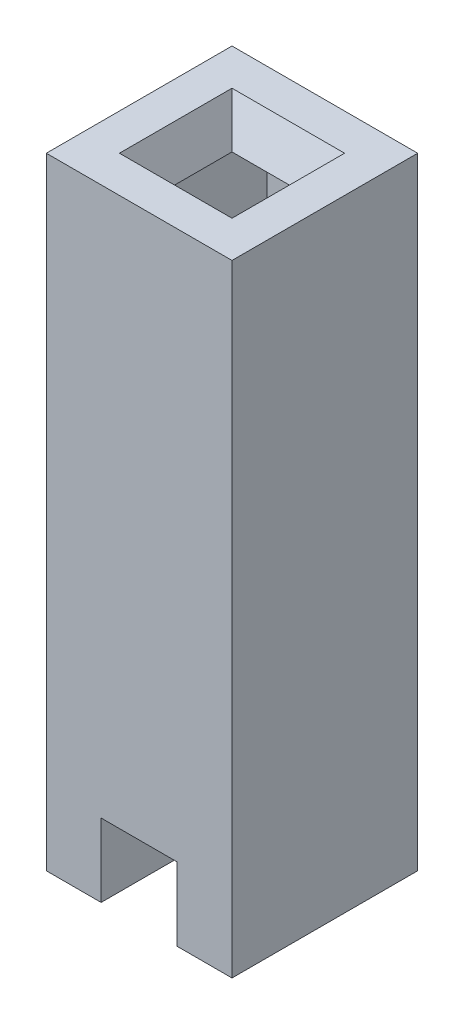
ISO-10303-21;
HEADER;
FILE_DESCRIPTION(('STEP AP214'),'2;1');
FILE_NAME('part.step','',(''),(''),'','','');
FILE_SCHEMA(('AUTOMOTIVE_DESIGN { 1 0 10303 214 1 1 1 1 }'));
ENDSEC;
DATA;
#1=APPLICATION_CONTEXT('core data for automotive mechanical design processes');
#2=APPLICATION_PROTOCOL_DEFINITION('international standard','automotive_design',2000,#1);
#3=PRODUCT_CONTEXT('',#1,'mechanical');
#4=PRODUCT('Part','Part','',(#3));
#5=PRODUCT_RELATED_PRODUCT_CATEGORY('part','',(#4));
#6=PRODUCT_DEFINITION_FORMATION('','',#4);
#7=PRODUCT_DEFINITION_CONTEXT('part definition',#1,'design');
#8=PRODUCT_DEFINITION('design','',#6,#7);
#9=PRODUCT_DEFINITION_SHAPE('','',#8);
#10=(LENGTH_UNIT() NAMED_UNIT(*) SI_UNIT(.MILLI.,.METRE.));
#11=(NAMED_UNIT(*) PLANE_ANGLE_UNIT() SI_UNIT($,.RADIAN.));
#12=(NAMED_UNIT(*) SI_UNIT($,.STERADIAN.) SOLID_ANGLE_UNIT());
#13=UNCERTAINTY_MEASURE_WITH_UNIT(LENGTH_MEASURE(1.E-05),#10,'distance_accuracy_value','');
#14=(GEOMETRIC_REPRESENTATION_CONTEXT(3) GLOBAL_UNCERTAINTY_ASSIGNED_CONTEXT((#13)) GLOBAL_UNIT_ASSIGNED_CONTEXT((#10,
#11,#12)) REPRESENTATION_CONTEXT('',''));
#15=CARTESIAN_POINT('',(0.,0.,0.));
#16=DIRECTION('',(0.,0.,1.));
#17=DIRECTION('',(1.,0.,0.));
#18=AXIS2_PLACEMENT_3D('',#15,#16,#17);
#19=CARTESIAN_POINT('',(-0.75,1.,2.54));
#20=DIRECTION('',(0.,1.,0.));
#21=DIRECTION('',(-1.,0.,0.));
#22=AXIS2_PLACEMENT_3D('',#19,#20,#21);
#23=PLANE('',#22);
#24=DIRECTION('',(0.,0.,-1.));
#25=VECTOR('',#24,1.);
#26=CARTESIAN_POINT('',(-1.79,1.,2.54));
#27=LINE('',#26,#25);
#28=CARTESIAN_POINT('',(-1.79,1.,2.54));
#29=VERTEX_POINT('',#28);
#30=CARTESIAN_POINT('',(-1.79,1.,2.27));
#31=VERTEX_POINT('',#30);
#32=EDGE_CURVE('E256',#29,#31,#27,.T.);
#33=ORIENTED_EDGE('',*,*,#32,.T.);
#34=DIRECTION('',(-1.,0.,0.));
#35=VECTOR('',#34,1.);
#36=CARTESIAN_POINT('',(-1.79,1.,2.27));
#37=LINE('',#36,#35);
#38=CARTESIAN_POINT('',(-0.75,1.,2.27));
#39=VERTEX_POINT('',#38);
#40=EDGE_CURVE('E197',#39,#31,#37,.T.);
#41=ORIENTED_EDGE('',*,*,#40,.F.);
#42=DIRECTION('',(0.,0.,-1.));
#43=VECTOR('',#42,1.);
#44=CARTESIAN_POINT('',(-0.75,1.,2.54));
#45=LINE('',#44,#43);
#46=CARTESIAN_POINT('',(-0.75,1.,2.54));
#47=VERTEX_POINT('',#46);
#48=EDGE_CURVE('E252',#47,#39,#45,.T.);
#49=ORIENTED_EDGE('',*,*,#48,.F.);
#50=DIRECTION('',(1.,0.,0.));
#51=VECTOR('',#50,1.);
#52=CARTESIAN_POINT('',(-0.75,1.,2.54));
#53=LINE('',#52,#51);
#54=EDGE_CURVE('E222',#29,#47,#53,.T.);
#55=ORIENTED_EDGE('',*,*,#54,.F.);
#56=EDGE_LOOP('',(#33,#41,#49,#55));
#57=FACE_BOUND('',#56,.T.);
#58=ADVANCED_FACE('F36',(#57),#23,.F.);
#59=CARTESIAN_POINT('',(0.,0.,2.54));
#60=DIRECTION('',(-1.,0.,0.));
#61=DIRECTION('',(0.,-1.,0.));
#62=AXIS2_PLACEMENT_3D('',#59,#60,#61);
#63=PLANE('',#62);
#64=DIRECTION('',(0.,1.,0.));
#65=VECTOR('',#64,1.);
#66=CARTESIAN_POINT('',(0.,0.,0.));
#67=LINE('',#66,#65);
#68=CARTESIAN_POINT('',(0.,0.,0.));
#69=VERTEX_POINT('',#68);
#70=CARTESIAN_POINT('',(0.,8.5,0.));
#71=VERTEX_POINT('',#70);
#72=EDGE_CURVE('E209',#69,#71,#67,.T.);
#73=ORIENTED_EDGE('',*,*,#72,.T.);
#74=DIRECTION('',(0.,0.,-1.));
#75=VECTOR('',#74,1.);
#76=CARTESIAN_POINT('',(0.,8.5,2.54));
#77=LINE('',#76,#75);
#78=CARTESIAN_POINT('',(0.,8.5,2.54));
#79=VERTEX_POINT('',#78);
#80=EDGE_CURVE('E12',#79,#71,#77,.T.);
#81=ORIENTED_EDGE('',*,*,#80,.F.);
#82=DIRECTION('',(0.,1.,0.));
#83=VECTOR('',#82,1.);
#84=CARTESIAN_POINT('',(0.,0.,2.54));
#85=LINE('',#84,#83);
#86=CARTESIAN_POINT('',(0.,0.,2.54));
#87=VERTEX_POINT('',#86);
#88=EDGE_CURVE('E210',#87,#79,#85,.T.);
#89=ORIENTED_EDGE('',*,*,#88,.F.);
#90=DIRECTION('',(0.,0.,-1.));
#91=VECTOR('',#90,1.);
#92=CARTESIAN_POINT('',(0.,0.,2.54));
#93=LINE('',#92,#91);
#94=EDGE_CURVE('E228',#87,#69,#93,.T.);
#95=ORIENTED_EDGE('',*,*,#94,.T.);
#96=EDGE_LOOP('',(#73,#81,#89,#95));
#97=FACE_BOUND('',#96,.T.);
#98=ADVANCED_FACE('F38',(#97),#63,.F.);
#99=CARTESIAN_POINT('',(0.,8.5,2.54));
#100=DIRECTION('',(0.,-1.,0.));
#101=DIRECTION('',(0.,0.,-1.));
#102=AXIS2_PLACEMENT_3D('',#99,#100,#101);
#103=PLANE('',#102);
#104=DIRECTION('',(-1.,0.,0.));
#105=VECTOR('',#104,1.);
#106=CARTESIAN_POINT('',(-0.5,8.5,0.5));
#107=LINE('',#106,#105);
#108=CARTESIAN_POINT('',(-0.5,8.5,0.5));
#109=VERTEX_POINT('',#108);
#110=CARTESIAN_POINT('',(-2.04,8.5,0.5));
#111=VERTEX_POINT('',#110);
#112=EDGE_CURVE('E172',#109,#111,#107,.T.);
#113=ORIENTED_EDGE('',*,*,#112,.F.);
#114=DIRECTION('',(0.,0.,-1.));
#115=VECTOR('',#114,1.);
#116=CARTESIAN_POINT('',(-0.5,8.5,2.04));
#117=LINE('',#116,#115);
#118=CARTESIAN_POINT('',(-0.5,8.5,2.04));
#119=VERTEX_POINT('',#118);
#120=EDGE_CURVE('E51',#119,#109,#117,.T.);
#121=ORIENTED_EDGE('',*,*,#120,.F.);
#122=DIRECTION('',(1.,0.,0.));
#123=VECTOR('',#122,1.);
#124=CARTESIAN_POINT('',(-2.04,8.5,2.04));
#125=LINE('',#124,#123);
#126=CARTESIAN_POINT('',(-2.04,8.5,2.04));
#127=VERTEX_POINT('',#126);
#128=EDGE_CURVE('E159',#127,#119,#125,.T.);
#129=ORIENTED_EDGE('',*,*,#128,.F.);
#130=DIRECTION('',(0.,0.,1.));
#131=VECTOR('',#130,1.);
#132=CARTESIAN_POINT('',(-2.04,8.5,0.5));
#133=LINE('',#132,#131);
#134=EDGE_CURVE('E167',#111,#127,#133,.T.);
#135=ORIENTED_EDGE('',*,*,#134,.F.);
#136=EDGE_LOOP('',(#113,#121,#129,#135));
#137=FACE_BOUND('',#136,.T.);
#138=DIRECTION('',(-1.,0.,0.));
#139=VECTOR('',#138,1.);
#140=CARTESIAN_POINT('',(0.,8.5,0.));
#141=LINE('',#140,#139);
#142=CARTESIAN_POINT('',(-2.54,8.5,0.));
#143=VERTEX_POINT('',#142);
#144=EDGE_CURVE('E231',#71,#143,#141,.T.);
#145=ORIENTED_EDGE('',*,*,#144,.T.);
#146=DIRECTION('',(0.,0.,-1.));
#147=VECTOR('',#146,1.);
#148=CARTESIAN_POINT('',(-2.54,8.5,2.54));
#149=LINE('',#148,#147);
#150=CARTESIAN_POINT('',(-2.54,8.5,2.54));
#151=VERTEX_POINT('',#150);
#152=EDGE_CURVE('E44',#151,#143,#149,.T.);
#153=ORIENTED_EDGE('',*,*,#152,.F.);
#154=DIRECTION('',(-1.,0.,0.));
#155=VECTOR('',#154,1.);
#156=CARTESIAN_POINT('',(0.,8.5,2.54));
#157=LINE('',#156,#155);
#158=EDGE_CURVE('E213',#79,#151,#157,.T.);
#159=ORIENTED_EDGE('',*,*,#158,.F.);
#160=ORIENTED_EDGE('',*,*,#80,.T.);
#161=EDGE_LOOP('',(#145,#153,#159,#160));
#162=FACE_BOUND('',#161,.T.);
#163=ADVANCED_FACE('F170',(#137,#162),#103,.F.);
#164=CARTESIAN_POINT('',(-2.54,0.,2.54));
#165=DIRECTION('',(1.,0.,0.));
#166=DIRECTION('',(0.,0.,-1.));
#167=AXIS2_PLACEMENT_3D('',#164,#165,#166);
#168=PLANE('',#167);
#169=DIRECTION('',(0.,-1.,0.));
#170=VECTOR('',#169,1.);
#171=CARTESIAN_POINT('',(-2.54,0.,0.));
#172=LINE('',#171,#170);
#173=CARTESIAN_POINT('',(-2.54,0.,0.));
#174=VERTEX_POINT('',#173);
#175=EDGE_CURVE('E233',#143,#174,#172,.T.);
#176=ORIENTED_EDGE('',*,*,#175,.T.);
#177=DIRECTION('',(0.,0.,-1.));
#178=VECTOR('',#177,1.);
#179=CARTESIAN_POINT('',(-2.54,0.,2.54));
#180=LINE('',#179,#178);
#181=CARTESIAN_POINT('',(-2.54,0.,2.54));
#182=VERTEX_POINT('',#181);
#183=EDGE_CURVE('E262',#182,#174,#180,.T.);
#184=ORIENTED_EDGE('',*,*,#183,.F.);
#185=DIRECTION('',(0.,-1.,0.));
#186=VECTOR('',#185,1.);
#187=CARTESIAN_POINT('',(-2.54,0.,2.54));
#188=LINE('',#187,#186);
#189=EDGE_CURVE('E216',#151,#182,#188,.T.);
#190=ORIENTED_EDGE('',*,*,#189,.F.);
#191=ORIENTED_EDGE('',*,*,#152,.T.);
#192=EDGE_LOOP('',(#176,#184,#190,#191));
#193=FACE_BOUND('',#192,.T.);
#194=ADVANCED_FACE('F269',(#193),#168,.F.);
#195=CARTESIAN_POINT('',(-1.79,0.,2.54));
#196=DIRECTION('',(0.,1.,0.));
#197=DIRECTION('',(-1.,0.,0.));
#198=AXIS2_PLACEMENT_3D('',#195,#196,#197);
#199=PLANE('',#198);
#200=DIRECTION('',(1.,0.,0.));
#201=VECTOR('',#200,1.);
#202=CARTESIAN_POINT('',(-1.79,0.,0.));
#203=LINE('',#202,#201);
#204=CARTESIAN_POINT('',(-1.79,0.,0.));
#205=VERTEX_POINT('',#204);
#206=EDGE_CURVE('E235',#174,#205,#203,.T.);
#207=ORIENTED_EDGE('',*,*,#206,.T.);
#208=DIRECTION('',(0.,0.,-1.));
#209=VECTOR('',#208,1.);
#210=CARTESIAN_POINT('',(-1.79,0.,2.54));
#211=LINE('',#210,#209);
#212=CARTESIAN_POINT('',(-1.79,0.,2.54));
#213=VERTEX_POINT('',#212);
#214=EDGE_CURVE('E259',#213,#205,#211,.T.);
#215=ORIENTED_EDGE('',*,*,#214,.F.);
#216=DIRECTION('',(1.,0.,0.));
#217=VECTOR('',#216,1.);
#218=CARTESIAN_POINT('',(-1.79,0.,2.54));
#219=LINE('',#218,#217);
#220=EDGE_CURVE('E218',#182,#213,#219,.T.);
#221=ORIENTED_EDGE('',*,*,#220,.F.);
#222=ORIENTED_EDGE('',*,*,#183,.T.);
#223=EDGE_LOOP('',(#207,#215,#221,#222));
#224=FACE_BOUND('',#223,.T.);
#225=ADVANCED_FACE('F279',(#224),#199,.F.);
#226=CARTESIAN_POINT('',(-1.79,0.,2.54));
#227=DIRECTION('',(-1.,0.,0.));
#228=DIRECTION('',(0.,0.,1.));
#229=AXIS2_PLACEMENT_3D('',#226,#227,#228);
#230=PLANE('',#229);
#231=DIRECTION('',(0.,1.,0.));
#232=VECTOR('',#231,1.);
#233=CARTESIAN_POINT('',(-1.79,0.,0.));
#234=LINE('',#233,#232);
#235=CARTESIAN_POINT('',(-1.79,1.,0.));
#236=VERTEX_POINT('',#235);
#237=EDGE_CURVE('E237',#205,#236,#234,.T.);
#238=ORIENTED_EDGE('',*,*,#237,.T.);
#239=CARTESIAN_POINT('',(-1.79,1.,0.27));
#240=VERTEX_POINT('',#239);
#241=EDGE_CURVE('E255',#240,#236,#27,.T.);
#242=ORIENTED_EDGE('',*,*,#241,.F.);
#243=DIRECTION('',(0.,-1.,0.));
#244=VECTOR('',#243,1.);
#245=CARTESIAN_POINT('',(-1.79,10.7542404485769,0.27));
#246=LINE('',#245,#244);
#247=CARTESIAN_POINT('',(-1.79,8.,0.27));
#248=VERTEX_POINT('',#247);
#249=EDGE_CURVE('E200',#248,#240,#246,.T.);
#250=ORIENTED_EDGE('',*,*,#249,.F.);
#251=DIRECTION('',(0.,0.,1.));
#252=VECTOR('',#251,1.);
#253=CARTESIAN_POINT('',(-1.79,8.,2.27));
#254=LINE('',#253,#252);
#255=CARTESIAN_POINT('',(-1.79,8.,2.27));
#256=VERTEX_POINT('',#255);
#257=EDGE_CURVE('E193',#248,#256,#254,.T.);
#258=ORIENTED_EDGE('',*,*,#257,.T.);
#259=DIRECTION('',(0.,-1.,0.));
#260=VECTOR('',#259,1.);
#261=CARTESIAN_POINT('',(-1.79,10.7542404485769,2.27));
#262=LINE('',#261,#260);
#263=EDGE_CURVE('E191',#256,#31,#262,.T.);
#264=ORIENTED_EDGE('',*,*,#263,.T.);
#265=ORIENTED_EDGE('',*,*,#32,.F.);
#266=DIRECTION('',(0.,1.,0.));
#267=VECTOR('',#266,1.);
#268=CARTESIAN_POINT('',(-1.79,0.,2.54));
#269=LINE('',#268,#267);
#270=EDGE_CURVE('E220',#213,#29,#269,.T.);
#271=ORIENTED_EDGE('',*,*,#270,.F.);
#272=ORIENTED_EDGE('',*,*,#214,.T.);
#273=EDGE_LOOP('',(#238,#242,#250,#258,#264,#265,#271,#272));
#274=FACE_BOUND('',#273,.T.);
#275=ADVANCED_FACE('F283',(#274),#230,.F.);
#276=CARTESIAN_POINT('',(-0.75,1.,0.27));
#277=VERTEX_POINT('',#276);
#278=CARTESIAN_POINT('',(-0.75,1.,0.));
#279=VERTEX_POINT('',#278);
#280=EDGE_CURVE('E251',#277,#279,#45,.T.);
#281=ORIENTED_EDGE('',*,*,#280,.F.);
#282=DIRECTION('',(1.,0.,0.));
#283=VECTOR('',#282,1.);
#284=CARTESIAN_POINT('',(-1.79,1.,0.27));
#285=LINE('',#284,#283);
#286=EDGE_CURVE('E166',#240,#277,#285,.T.);
#287=ORIENTED_EDGE('',*,*,#286,.F.);
#288=ORIENTED_EDGE('',*,*,#241,.T.);
#289=DIRECTION('',(1.,0.,0.));
#290=VECTOR('',#289,1.);
#291=CARTESIAN_POINT('',(-0.75,1.,0.));
#292=LINE('',#291,#290);
#293=EDGE_CURVE('E240',#236,#279,#292,.T.);
#294=ORIENTED_EDGE('',*,*,#293,.T.);
#295=EDGE_LOOP('',(#281,#287,#288,#294));
#296=FACE_BOUND('',#295,.T.);
#297=ADVANCED_FACE('F307',(#296),#23,.F.);
#298=CARTESIAN_POINT('',(-0.75,0.,2.54));
#299=DIRECTION('',(1.,0.,0.));
#300=DIRECTION('',(0.,0.,-1.));
#301=AXIS2_PLACEMENT_3D('',#298,#299,#300);
#302=PLANE('',#301);
#303=DIRECTION('',(0.,-1.,0.));
#304=VECTOR('',#303,1.);
#305=CARTESIAN_POINT('',(-0.75,0.,0.));
#306=LINE('',#305,#304);
#307=CARTESIAN_POINT('',(-0.75,0.,0.));
#308=VERTEX_POINT('',#307);
#309=EDGE_CURVE('E243',#279,#308,#306,.T.);
#310=ORIENTED_EDGE('',*,*,#309,.T.);
#311=DIRECTION('',(0.,0.,-1.));
#312=VECTOR('',#311,1.);
#313=CARTESIAN_POINT('',(-0.75,0.,2.54));
#314=LINE('',#313,#312);
#315=CARTESIAN_POINT('',(-0.75,0.,2.54));
#316=VERTEX_POINT('',#315);
#317=EDGE_CURVE('E248',#316,#308,#314,.T.);
#318=ORIENTED_EDGE('',*,*,#317,.F.);
#319=DIRECTION('',(0.,-1.,0.));
#320=VECTOR('',#319,1.);
#321=CARTESIAN_POINT('',(-0.75,0.,2.54));
#322=LINE('',#321,#320);
#323=EDGE_CURVE('E224',#47,#316,#322,.T.);
#324=ORIENTED_EDGE('',*,*,#323,.F.);
#325=ORIENTED_EDGE('',*,*,#48,.T.);
#326=DIRECTION('',(0.,-1.,0.));
#327=VECTOR('',#326,1.);
#328=CARTESIAN_POINT('',(-0.750000000000002,10.7542404485769,2.27));
#329=LINE('',#328,#327);
#330=CARTESIAN_POINT('',(-0.750000000000002,8.,2.27));
#331=VERTEX_POINT('',#330);
#332=EDGE_CURVE('E202',#331,#39,#329,.T.);
#333=ORIENTED_EDGE('',*,*,#332,.F.);
#334=DIRECTION('',(0.,0.,-1.));
#335=VECTOR('',#334,1.);
#336=CARTESIAN_POINT('',(-0.750000000000002,8.,2.27));
#337=LINE('',#336,#335);
#338=CARTESIAN_POINT('',(-0.750000000000002,8.,0.27));
#339=VERTEX_POINT('',#338);
#340=EDGE_CURVE('E188',#331,#339,#337,.T.);
#341=ORIENTED_EDGE('',*,*,#340,.T.);
#342=DIRECTION('',(0.,-1.,0.));
#343=VECTOR('',#342,1.);
#344=CARTESIAN_POINT('',(-0.750000000000002,10.7542404485769,0.27));
#345=LINE('',#344,#343);
#346=EDGE_CURVE('E204',#339,#277,#345,.T.);
#347=ORIENTED_EDGE('',*,*,#346,.T.);
#348=ORIENTED_EDGE('',*,*,#280,.T.);
#349=EDGE_LOOP('',(#310,#318,#324,#325,#333,#341,#347,#348));
#350=FACE_BOUND('',#349,.T.);
#351=ADVANCED_FACE('F302',(#350),#302,.F.);
#352=CARTESIAN_POINT('',(0.,0.,2.54));
#353=DIRECTION('',(0.,1.,0.));
#354=DIRECTION('',(-1.,0.,0.));
#355=AXIS2_PLACEMENT_3D('',#352,#353,#354);
#356=PLANE('',#355);
#357=DIRECTION('',(1.,0.,0.));
#358=VECTOR('',#357,1.);
#359=CARTESIAN_POINT('',(0.,0.,0.));
#360=LINE('',#359,#358);
#361=EDGE_CURVE('E214',#308,#69,#360,.T.);
#362=ORIENTED_EDGE('',*,*,#361,.T.);
#363=ORIENTED_EDGE('',*,*,#94,.F.);
#364=DIRECTION('',(1.,0.,0.));
#365=VECTOR('',#364,1.);
#366=CARTESIAN_POINT('',(0.,0.,2.54));
#367=LINE('',#366,#365);
#368=EDGE_CURVE('E226',#316,#87,#367,.T.);
#369=ORIENTED_EDGE('',*,*,#368,.F.);
#370=ORIENTED_EDGE('',*,*,#317,.T.);
#371=EDGE_LOOP('',(#362,#363,#369,#370));
#372=FACE_BOUND('',#371,.T.);
#373=ADVANCED_FACE('F297',(#372),#356,.F.);
#374=CARTESIAN_POINT('',(0.,0.,2.54));
#375=DIRECTION('',(0.,0.,1.));
#376=DIRECTION('',(1.,0.,0.));
#377=AXIS2_PLACEMENT_3D('',#374,#375,#376);
#378=PLANE('',#377);
#379=ORIENTED_EDGE('',*,*,#88,.T.);
#380=ORIENTED_EDGE('',*,*,#158,.T.);
#381=ORIENTED_EDGE('',*,*,#189,.T.);
#382=ORIENTED_EDGE('',*,*,#220,.T.);
#383=ORIENTED_EDGE('',*,*,#270,.T.);
#384=ORIENTED_EDGE('',*,*,#54,.T.);
#385=ORIENTED_EDGE('',*,*,#323,.T.);
#386=ORIENTED_EDGE('',*,*,#368,.T.);
#387=EDGE_LOOP('',(#379,#380,#381,#382,#383,#384,#385,#386));
#388=FACE_BOUND('',#387,.T.);
#389=ADVANCED_FACE('F288',(#388),#378,.T.);
#390=CARTESIAN_POINT('',(0.,0.,0.));
#391=DIRECTION('',(0.,0.,1.));
#392=DIRECTION('',(1.,0.,0.));
#393=AXIS2_PLACEMENT_3D('',#390,#391,#392);
#394=PLANE('',#393);
#395=ORIENTED_EDGE('',*,*,#72,.F.);
#396=ORIENTED_EDGE('',*,*,#361,.F.);
#397=ORIENTED_EDGE('',*,*,#309,.F.);
#398=ORIENTED_EDGE('',*,*,#293,.F.);
#399=ORIENTED_EDGE('',*,*,#237,.F.);
#400=ORIENTED_EDGE('',*,*,#206,.F.);
#401=ORIENTED_EDGE('',*,*,#175,.F.);
#402=ORIENTED_EDGE('',*,*,#144,.F.);
#403=EDGE_LOOP('',(#395,#396,#397,#398,#399,#400,#401,#402));
#404=FACE_BOUND('',#403,.T.);
#405=ADVANCED_FACE('F274',(#404),#394,.F.);
#406=CARTESIAN_POINT('',(-1.79,10.7542404485769,2.27));
#407=DIRECTION('',(0.,0.,1.));
#408=DIRECTION('',(1.,0.,0.));
#409=AXIS2_PLACEMENT_3D('',#406,#407,#408);
#410=PLANE('',#409);
#411=DIRECTION('',(1.,0.,0.));
#412=VECTOR('',#411,1.);
#413=CARTESIAN_POINT('',(-1.79,8.,2.27));
#414=LINE('',#413,#412);
#415=EDGE_CURVE('E190',#256,#331,#414,.T.);
#416=ORIENTED_EDGE('',*,*,#415,.T.);
#417=ORIENTED_EDGE('',*,*,#332,.T.);
#418=ORIENTED_EDGE('',*,*,#40,.T.);
#419=ORIENTED_EDGE('',*,*,#263,.F.);
#420=EDGE_LOOP('',(#416,#417,#418,#419));
#421=FACE_BOUND('',#420,.T.);
#422=ADVANCED_FACE('F320',(#421),#410,.F.);
#423=CARTESIAN_POINT('',(-1.79,10.7542404485769,0.27));
#424=DIRECTION('',(0.,0.,-1.));
#425=DIRECTION('',(-1.,0.,0.));
#426=AXIS2_PLACEMENT_3D('',#423,#424,#425);
#427=PLANE('',#426);
#428=DIRECTION('',(-1.,0.,0.));
#429=VECTOR('',#428,1.);
#430=CARTESIAN_POINT('',(-1.79,8.,0.27));
#431=LINE('',#430,#429);
#432=EDGE_CURVE('E195',#339,#248,#431,.T.);
#433=ORIENTED_EDGE('',*,*,#432,.T.);
#434=ORIENTED_EDGE('',*,*,#249,.T.);
#435=ORIENTED_EDGE('',*,*,#286,.T.);
#436=ORIENTED_EDGE('',*,*,#346,.F.);
#437=EDGE_LOOP('',(#433,#434,#435,#436));
#438=FACE_BOUND('',#437,.T.);
#439=ADVANCED_FACE('F312',(#438),#427,.F.);
#440=CARTESIAN_POINT('',(0.,8.,2.54));
#441=DIRECTION('',(0.,-1.,0.));
#442=DIRECTION('',(0.,0.,-1.));
#443=AXIS2_PLACEMENT_3D('',#440,#441,#442);
#444=PLANE('',#443);
#445=DIRECTION('',(0.,0.,-1.));
#446=VECTOR('',#445,1.);
#447=CARTESIAN_POINT('',(-0.754762724747216,8.,2.04));
#448=LINE('',#447,#446);
#449=CARTESIAN_POINT('',(-0.754762724747216,8.,1.78523727525278));
#450=VERTEX_POINT('',#449);
#451=CARTESIAN_POINT('',(-0.754762724747216,8.,0.754762724747215));
#452=VERTEX_POINT('',#451);
#453=EDGE_CURVE('E152',#450,#452,#448,.T.);
#454=ORIENTED_EDGE('',*,*,#453,.T.);
#455=DIRECTION('',(-1.,0.,0.));
#456=VECTOR('',#455,1.);
#457=CARTESIAN_POINT('',(-0.5,8.,0.754762724747215));
#458=LINE('',#457,#456);
#459=CARTESIAN_POINT('',(-1.78523727525278,8.,0.754762724747215));
#460=VERTEX_POINT('',#459);
#461=EDGE_CURVE('E175',#452,#460,#458,.T.);
#462=ORIENTED_EDGE('',*,*,#461,.T.);
#463=DIRECTION('',(0.,0.,1.));
#464=VECTOR('',#463,1.);
#465=CARTESIAN_POINT('',(-1.78523727525279,8.,0.5));
#466=LINE('',#465,#464);
#467=CARTESIAN_POINT('',(-1.78523727525279,8.,1.78523727525278));
#468=VERTEX_POINT('',#467);
#469=EDGE_CURVE('E155',#460,#468,#466,.T.);
#470=ORIENTED_EDGE('',*,*,#469,.T.);
#471=DIRECTION('',(1.,0.,0.));
#472=VECTOR('',#471,1.);
#473=CARTESIAN_POINT('',(-2.04,8.,1.78523727525278));
#474=LINE('',#473,#472);
#475=EDGE_CURVE('E156',#468,#450,#474,.T.);
#476=ORIENTED_EDGE('',*,*,#475,.T.);
#477=EDGE_LOOP('',(#454,#462,#470,#476));
#478=FACE_BOUND('',#477,.T.);
#479=ORIENTED_EDGE('',*,*,#257,.F.);
#480=ORIENTED_EDGE('',*,*,#432,.F.);
#481=ORIENTED_EDGE('',*,*,#340,.F.);
#482=ORIENTED_EDGE('',*,*,#415,.F.);
#483=EDGE_LOOP('',(#479,#480,#481,#482));
#484=FACE_BOUND('',#483,.T.);
#485=ADVANCED_FACE('F316',(#478,#484),#444,.T.);
#486=CARTESIAN_POINT('',(-0.5,8.5,2.04));
#487=DIRECTION('',(0.891006524188367,-0.453990499739548,0.));
#488=DIRECTION('',(0.453990499739548,0.891006524188367,0.));
#489=AXIS2_PLACEMENT_3D('',#486,#487,#488);
#490=PLANE('',#489);
#491=DIRECTION('',(0.413384109704205,0.811311996514364,0.413384109704205));
#492=VECTOR('',#491,1.);
#493=CARTESIAN_POINT('',(-0.763165090120145,7.983509429448,1.77683490987986));
#494=LINE('',#493,#492);
#495=EDGE_CURVE('E148',#450,#119,#494,.T.);
#496=ORIENTED_EDGE('',*,*,#495,.T.);
#497=ORIENTED_EDGE('',*,*,#120,.T.);
#498=DIRECTION('',(0.413384109704205,0.811311996514364,-0.413384109704205));
#499=VECTOR('',#498,1.);
#500=CARTESIAN_POINT('',(-0.763165090120145,7.983509429448,0.763165090120145));
#501=LINE('',#500,#499);
#502=EDGE_CURVE('E182',#452,#109,#501,.T.);
#503=ORIENTED_EDGE('',*,*,#502,.F.);
#504=ORIENTED_EDGE('',*,*,#453,.F.);
#505=EDGE_LOOP('',(#496,#497,#503,#504));
#506=FACE_BOUND('',#505,.T.);
#507=ADVANCED_FACE('F150',(#506),#490,.F.);
#508=CARTESIAN_POINT('',(-2.04,8.5,2.04));
#509=DIRECTION('',(0.,-0.453990499739548,0.891006524188367));
#510=DIRECTION('',(0.,-0.891006524188367,-0.453990499739548));
#511=AXIS2_PLACEMENT_3D('',#508,#509,#510);
#512=PLANE('',#511);
#513=DIRECTION('',(-0.413384109704205,0.811311996514364,0.413384109704205));
#514=VECTOR('',#513,1.);
#515=CARTESIAN_POINT('',(-1.77683490987986,7.983509429448,1.77683490987986));
#516=LINE('',#515,#514);
#517=EDGE_CURVE('E162',#468,#127,#516,.T.);
#518=ORIENTED_EDGE('',*,*,#517,.T.);
#519=ORIENTED_EDGE('',*,*,#128,.T.);
#520=ORIENTED_EDGE('',*,*,#495,.F.);
#521=ORIENTED_EDGE('',*,*,#475,.F.);
#522=EDGE_LOOP('',(#518,#519,#520,#521));
#523=FACE_BOUND('',#522,.T.);
#524=ADVANCED_FACE('F160',(#523),#512,.F.);
#525=CARTESIAN_POINT('',(-2.04,8.5,0.5));
#526=DIRECTION('',(-0.891006524188367,-0.453990499739548,0.));
#527=DIRECTION('',(0.453990499739548,-0.891006524188367,0.));
#528=AXIS2_PLACEMENT_3D('',#525,#526,#527);
#529=PLANE('',#528);
#530=DIRECTION('',(-0.413384109704205,0.811311996514364,-0.413384109704205));
#531=VECTOR('',#530,1.);
#532=CARTESIAN_POINT('',(-1.77683490987986,7.983509429448,0.763165090120145));
#533=LINE('',#532,#531);
#534=EDGE_CURVE('E59',#460,#111,#533,.T.);
#535=ORIENTED_EDGE('',*,*,#534,.T.);
#536=ORIENTED_EDGE('',*,*,#134,.T.);
#537=ORIENTED_EDGE('',*,*,#517,.F.);
#538=ORIENTED_EDGE('',*,*,#469,.F.);
#539=EDGE_LOOP('',(#535,#536,#537,#538));
#540=FACE_BOUND('',#539,.T.);
#541=ADVANCED_FACE('F435',(#540),#529,.F.);
#542=CARTESIAN_POINT('',(-0.5,8.5,0.5));
#543=DIRECTION('',(0.,-0.453990499739548,-0.891006524188367));
#544=DIRECTION('',(0.,0.891006524188367,-0.453990499739548));
#545=AXIS2_PLACEMENT_3D('',#542,#543,#544);
#546=PLANE('',#545);
#547=ORIENTED_EDGE('',*,*,#502,.T.);
#548=ORIENTED_EDGE('',*,*,#112,.T.);
#549=ORIENTED_EDGE('',*,*,#534,.F.);
#550=ORIENTED_EDGE('',*,*,#461,.F.);
#551=EDGE_LOOP('',(#547,#548,#549,#550));
#552=FACE_BOUND('',#551,.T.);
#553=ADVANCED_FACE('F442',(#552),#546,.F.);
#554=CLOSED_SHELL('',(#58,#98,#163,#194,#225,#275,#297,#351,#373,#389,#405,#422,#439,#485,#507,
#524,#541,#553));
#555=MANIFOLD_SOLID_BREP('B2',#554);
#556=ADVANCED_BREP_SHAPE_REPRESENTATION('',(#18,#555),#14);
#557=SHAPE_DEFINITION_REPRESENTATION(#9,#556);
ENDSEC;
END-ISO-10303-21;
